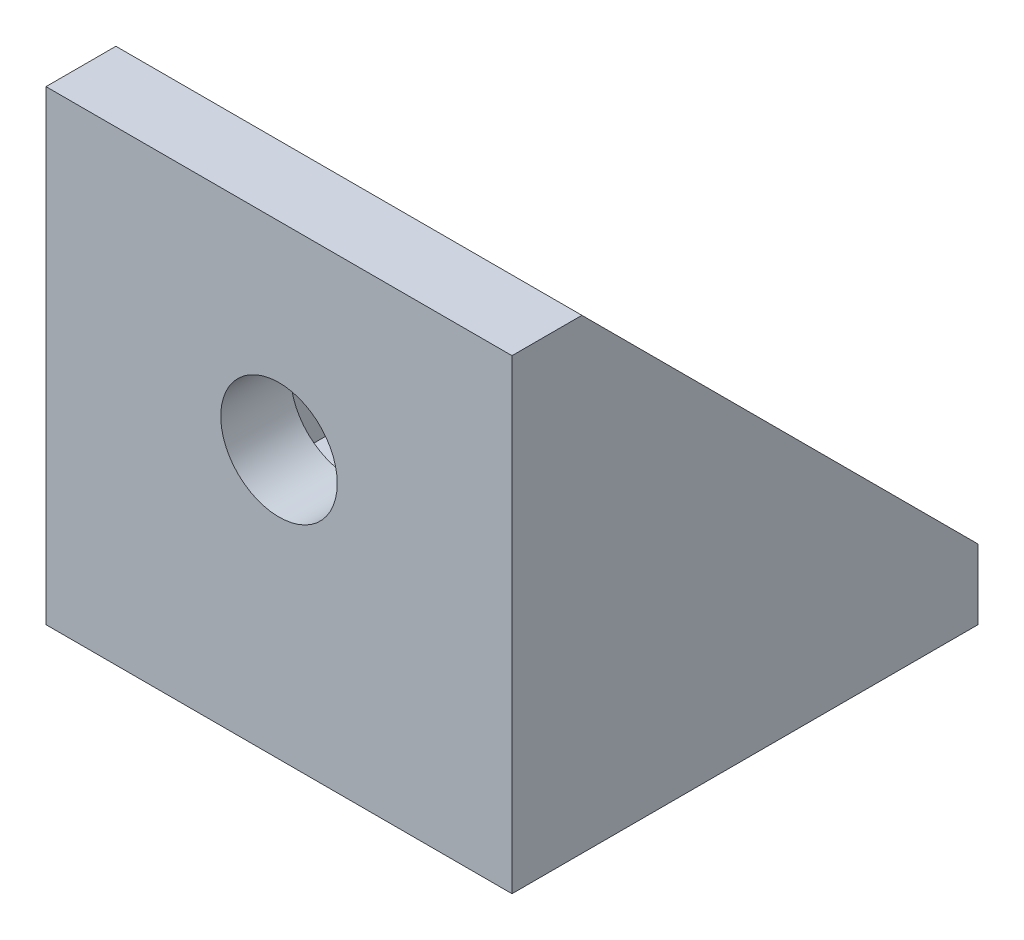
ISO-10303-21;
HEADER;
FILE_DESCRIPTION(('STEP AP214'),'2;1');
FILE_NAME('part.step','',(''),(''),'','','');
FILE_SCHEMA(('AUTOMOTIVE_DESIGN { 1 0 10303 214 1 1 1 1 }'));
ENDSEC;
DATA;
#1=APPLICATION_CONTEXT('core data for automotive mechanical design processes');
#2=APPLICATION_PROTOCOL_DEFINITION('international standard','automotive_design',2000,#1);
#3=PRODUCT_CONTEXT('',#1,'mechanical');
#4=PRODUCT('Part','Part','',(#3));
#5=PRODUCT_RELATED_PRODUCT_CATEGORY('part','',(#4));
#6=PRODUCT_DEFINITION_FORMATION('','',#4);
#7=PRODUCT_DEFINITION_CONTEXT('part definition',#1,'design');
#8=PRODUCT_DEFINITION('design','',#6,#7);
#9=PRODUCT_DEFINITION_SHAPE('','',#8);
#10=(LENGTH_UNIT() NAMED_UNIT(*) SI_UNIT(.MILLI.,.METRE.));
#11=(NAMED_UNIT(*) PLANE_ANGLE_UNIT() SI_UNIT($,.RADIAN.));
#12=(NAMED_UNIT(*) SI_UNIT($,.STERADIAN.) SOLID_ANGLE_UNIT());
#13=UNCERTAINTY_MEASURE_WITH_UNIT(LENGTH_MEASURE(1.E-05),#10,'distance_accuracy_value','');
#14=(GEOMETRIC_REPRESENTATION_CONTEXT(3) GLOBAL_UNCERTAINTY_ASSIGNED_CONTEXT((#13)) GLOBAL_UNIT_ASSIGNED_CONTEXT((#10,
#11,#12)) REPRESENTATION_CONTEXT('',''));
#15=CARTESIAN_POINT('',(0.,0.,0.));
#16=DIRECTION('',(0.,0.,1.));
#17=DIRECTION('',(1.,0.,0.));
#18=AXIS2_PLACEMENT_3D('',#15,#16,#17);
#19=CARTESIAN_POINT('',(0.,3.,0.));
#20=DIRECTION('',(0.,1.,0.));
#21=DIRECTION('',(0.,0.,1.));
#22=AXIS2_PLACEMENT_3D('',#19,#20,#21);
#23=PLANE('',#22);
#24=CARTESIAN_POINT('',(0.,3.,-1.5));
#25=DIRECTION('',(0.,1.,0.));
#26=DIRECTION('',(0.,0.,1.));
#27=AXIS2_PLACEMENT_3D('',#24,#25,#26);
#28=CIRCLE('',#27,2.5);
#29=CARTESIAN_POINT('',(0.,3.,1.));
#30=VERTEX_POINT('',#29);
#31=EDGE_CURVE('E227',#30,#30,#28,.T.);
#32=ORIENTED_EDGE('',*,*,#31,.F.);
#33=EDGE_LOOP('',(#32));
#34=FACE_BOUND('',#33,.T.);
#35=DIRECTION('',(0.,0.,-1.));
#36=VECTOR('',#35,1.);
#37=CARTESIAN_POINT('',(-8.,3.,-10.));
#38=LINE('',#37,#36);
#39=CARTESIAN_POINT('',(-8.,3.,7.));
#40=VERTEX_POINT('',#39);
#41=CARTESIAN_POINT('',(-8.,3.,-10.));
#42=VERTEX_POINT('',#41);
#43=EDGE_CURVE('E106',#40,#42,#38,.T.);
#44=ORIENTED_EDGE('',*,*,#43,.F.);
#45=DIRECTION('',(1.,0.,0.));
#46=VECTOR('',#45,1.);
#47=CARTESIAN_POINT('',(0.,3.,7.));
#48=LINE('',#47,#46);
#49=CARTESIAN_POINT('',(8.,3.,7.));
#50=VERTEX_POINT('',#49);
#51=EDGE_CURVE('E129',#40,#50,#48,.T.);
#52=ORIENTED_EDGE('',*,*,#51,.T.);
#53=DIRECTION('',(0.,0.,-1.));
#54=VECTOR('',#53,1.);
#55=CARTESIAN_POINT('',(8.,3.,-10.));
#56=LINE('',#55,#54);
#57=CARTESIAN_POINT('',(8.,3.,-10.));
#58=VERTEX_POINT('',#57);
#59=EDGE_CURVE('E140',#50,#58,#56,.T.);
#60=ORIENTED_EDGE('',*,*,#59,.T.);
#61=DIRECTION('',(-1.,0.,0.));
#62=VECTOR('',#61,1.);
#63=CARTESIAN_POINT('',(-10.,3.,-10.));
#64=LINE('',#63,#62);
#65=EDGE_CURVE('E154',#58,#42,#64,.T.);
#66=ORIENTED_EDGE('',*,*,#65,.T.);
#67=EDGE_LOOP('',(#44,#52,#60,#66));
#68=FACE_BOUND('',#67,.T.);
#69=ADVANCED_FACE('F34',(#34,#68),#23,.T.);
#70=CARTESIAN_POINT('',(0.,0.,7.));
#71=DIRECTION('',(0.,0.,1.));
#72=DIRECTION('',(1.,0.,0.));
#73=AXIS2_PLACEMENT_3D('',#70,#71,#72);
#74=PLANE('',#73);
#75=CARTESIAN_POINT('',(0.,11.5,7.));
#76=DIRECTION('',(0.,0.,1.));
#77=DIRECTION('',(1.,0.,0.));
#78=AXIS2_PLACEMENT_3D('',#75,#76,#77);
#79=CIRCLE('',#78,2.5);
#80=CARTESIAN_POINT('',(2.5,11.5,7.));
#81=VERTEX_POINT('',#80);
#82=EDGE_CURVE('E224',#81,#81,#79,.T.);
#83=ORIENTED_EDGE('',*,*,#82,.T.);
#84=EDGE_LOOP('',(#83));
#85=FACE_BOUND('',#84,.T.);
#86=ORIENTED_EDGE('',*,*,#51,.F.);
#87=DIRECTION('',(0.,-1.,0.));
#88=VECTOR('',#87,1.);
#89=CARTESIAN_POINT('',(-8.,3.,7.));
#90=LINE('',#89,#88);
#91=CARTESIAN_POINT('',(-8.,20.,7.));
#92=VERTEX_POINT('',#91);
#93=EDGE_CURVE('E104',#92,#40,#90,.T.);
#94=ORIENTED_EDGE('',*,*,#93,.F.);
#95=DIRECTION('',(-1.,0.,0.));
#96=VECTOR('',#95,1.);
#97=CARTESIAN_POINT('',(-10.,20.,7.));
#98=LINE('',#97,#96);
#99=CARTESIAN_POINT('',(8.,20.,7.));
#100=VERTEX_POINT('',#99);
#101=EDGE_CURVE('E127',#100,#92,#98,.T.);
#102=ORIENTED_EDGE('',*,*,#101,.F.);
#103=DIRECTION('',(0.,-1.,0.));
#104=VECTOR('',#103,1.);
#105=CARTESIAN_POINT('',(8.,3.,7.));
#106=LINE('',#105,#104);
#107=EDGE_CURVE('E238',#100,#50,#106,.T.);
#108=ORIENTED_EDGE('',*,*,#107,.T.);
#109=EDGE_LOOP('',(#86,#94,#102,#108));
#110=FACE_BOUND('',#109,.T.);
#111=ADVANCED_FACE('F125',(#85,#110),#74,.F.);
#112=CARTESIAN_POINT('',(10.,3.,-10.));
#113=DIRECTION('',(-1.,0.,0.));
#114=DIRECTION('',(0.,0.,1.));
#115=AXIS2_PLACEMENT_3D('',#112,#113,#114);
#116=PLANE('',#115);
#117=DIRECTION('',(0.,-1.,0.));
#118=VECTOR('',#117,1.);
#119=CARTESIAN_POINT('',(10.,3.,-10.));
#120=LINE('',#119,#118);
#121=CARTESIAN_POINT('',(10.,3.,-10.));
#122=VERTEX_POINT('',#121);
#123=CARTESIAN_POINT('',(10.,0.,-10.));
#124=VERTEX_POINT('',#123);
#125=EDGE_CURVE('E11',#122,#124,#120,.T.);
#126=ORIENTED_EDGE('',*,*,#125,.F.);
#127=DIRECTION('',(0.,0.707106781186548,0.707106781186548));
#128=VECTOR('',#127,1.);
#129=CARTESIAN_POINT('',(10.,3.,-10.));
#130=LINE('',#129,#128);
#131=CARTESIAN_POINT('',(10.,20.,7.));
#132=VERTEX_POINT('',#131);
#133=EDGE_CURVE('E119',#122,#132,#130,.T.);
#134=ORIENTED_EDGE('',*,*,#133,.T.);
#135=DIRECTION('',(0.,0.,1.));
#136=VECTOR('',#135,1.);
#137=CARTESIAN_POINT('',(10.,20.,7.));
#138=LINE('',#137,#136);
#139=CARTESIAN_POINT('',(10.,20.,10.));
#140=VERTEX_POINT('',#139);
#141=EDGE_CURVE('E138',#132,#140,#138,.T.);
#142=ORIENTED_EDGE('',*,*,#141,.T.);
#143=DIRECTION('',(0.,-1.,0.));
#144=VECTOR('',#143,1.);
#145=CARTESIAN_POINT('',(10.,3.,10.));
#146=LINE('',#145,#144);
#147=CARTESIAN_POINT('',(10.,0.,10.));
#148=VERTEX_POINT('',#147);
#149=EDGE_CURVE('E153',#140,#148,#146,.T.);
#150=ORIENTED_EDGE('',*,*,#149,.T.);
#151=DIRECTION('',(0.,0.,-1.));
#152=VECTOR('',#151,1.);
#153=CARTESIAN_POINT('',(10.,0.,-10.));
#154=LINE('',#153,#152);
#155=EDGE_CURVE('E150',#148,#124,#154,.T.);
#156=ORIENTED_EDGE('',*,*,#155,.T.);
#157=EDGE_LOOP('',(#126,#134,#142,#150,#156));
#158=FACE_BOUND('',#157,.T.);
#159=ADVANCED_FACE('F36',(#158),#116,.F.);
#160=CARTESIAN_POINT('',(-10.,3.,-10.));
#161=DIRECTION('',(0.,0.,1.));
#162=DIRECTION('',(1.,0.,0.));
#163=AXIS2_PLACEMENT_3D('',#160,#161,#162);
#164=PLANE('',#163);
#165=DIRECTION('',(-1.,0.,0.));
#166=VECTOR('',#165,1.);
#167=CARTESIAN_POINT('',(-10.,0.,-10.));
#168=LINE('',#167,#166);
#169=CARTESIAN_POINT('',(-10.,0.,-10.));
#170=VERTEX_POINT('',#169);
#171=EDGE_CURVE('E156',#124,#170,#168,.T.);
#172=ORIENTED_EDGE('',*,*,#171,.T.);
#173=DIRECTION('',(0.,-1.,0.));
#174=VECTOR('',#173,1.);
#175=CARTESIAN_POINT('',(-10.,3.,-10.));
#176=LINE('',#175,#174);
#177=CARTESIAN_POINT('',(-10.,3.,-10.));
#178=VERTEX_POINT('',#177);
#179=EDGE_CURVE('E43',#178,#170,#176,.T.);
#180=ORIENTED_EDGE('',*,*,#179,.F.);
#181=DIRECTION('',(-1.,0.,0.));
#182=VECTOR('',#181,1.);
#183=CARTESIAN_POINT('',(-8.,3.,-10.));
#184=LINE('',#183,#182);
#185=EDGE_CURVE('E120',#42,#178,#184,.T.);
#186=ORIENTED_EDGE('',*,*,#185,.F.);
#187=ORIENTED_EDGE('',*,*,#65,.F.);
#188=EDGE_CURVE('E151',#122,#58,#64,.T.);
#189=ORIENTED_EDGE('',*,*,#188,.F.);
#190=ORIENTED_EDGE('',*,*,#125,.T.);
#191=EDGE_LOOP('',(#172,#180,#186,#187,#189,#190));
#192=FACE_BOUND('',#191,.T.);
#193=ADVANCED_FACE('F182',(#192),#164,.F.);
#194=CARTESIAN_POINT('',(-10.,3.,-10.));
#195=DIRECTION('',(1.,0.,0.));
#196=DIRECTION('',(0.,0.,-1.));
#197=AXIS2_PLACEMENT_3D('',#194,#195,#196);
#198=PLANE('',#197);
#199=DIRECTION('',(0.,-1.,0.));
#200=VECTOR('',#199,1.);
#201=CARTESIAN_POINT('',(-10.,3.,10.));
#202=LINE('',#201,#200);
#203=CARTESIAN_POINT('',(-10.,20.,10.));
#204=VERTEX_POINT('',#203);
#205=CARTESIAN_POINT('',(-10.,0.,10.));
#206=VERTEX_POINT('',#205);
#207=EDGE_CURVE('E161',#204,#206,#202,.T.);
#208=ORIENTED_EDGE('',*,*,#207,.F.);
#209=DIRECTION('',(0.,0.,1.));
#210=VECTOR('',#209,1.);
#211=CARTESIAN_POINT('',(-10.,20.,7.));
#212=LINE('',#211,#210);
#213=CARTESIAN_POINT('',(-10.,20.,7.));
#214=VERTEX_POINT('',#213);
#215=EDGE_CURVE('E145',#214,#204,#212,.T.);
#216=ORIENTED_EDGE('',*,*,#215,.F.);
#217=DIRECTION('',(0.,0.707106781186548,0.707106781186548));
#218=VECTOR('',#217,1.);
#219=CARTESIAN_POINT('',(-10.,3.,-10.));
#220=LINE('',#219,#218);
#221=EDGE_CURVE('E109',#178,#214,#220,.T.);
#222=ORIENTED_EDGE('',*,*,#221,.F.);
#223=ORIENTED_EDGE('',*,*,#179,.T.);
#224=DIRECTION('',(0.,0.,1.));
#225=VECTOR('',#224,1.);
#226=CARTESIAN_POINT('',(-10.,0.,-10.));
#227=LINE('',#226,#225);
#228=EDGE_CURVE('E58',#170,#206,#227,.T.);
#229=ORIENTED_EDGE('',*,*,#228,.T.);
#230=EDGE_LOOP('',(#208,#216,#222,#223,#229));
#231=FACE_BOUND('',#230,.T.);
#232=ADVANCED_FACE('F164',(#231),#198,.F.);
#233=CARTESIAN_POINT('',(-10.,3.,10.));
#234=DIRECTION('',(0.,0.,-1.));
#235=DIRECTION('',(-1.,0.,0.));
#236=AXIS2_PLACEMENT_3D('',#233,#234,#235);
#237=PLANE('',#236);
#238=CARTESIAN_POINT('',(0.,11.5,10.));
#239=DIRECTION('',(0.,0.,1.));
#240=DIRECTION('',(1.,0.,0.));
#241=AXIS2_PLACEMENT_3D('',#238,#239,#240);
#242=CIRCLE('',#241,2.5);
#243=CARTESIAN_POINT('',(2.5,11.5,10.));
#244=VERTEX_POINT('',#243);
#245=EDGE_CURVE('E221',#244,#244,#242,.T.);
#246=ORIENTED_EDGE('',*,*,#245,.F.);
#247=EDGE_LOOP('',(#246));
#248=FACE_BOUND('',#247,.T.);
#249=DIRECTION('',(1.,0.,0.));
#250=VECTOR('',#249,1.);
#251=CARTESIAN_POINT('',(-10.,0.,10.));
#252=LINE('',#251,#250);
#253=EDGE_CURVE('E50',#206,#148,#252,.T.);
#254=ORIENTED_EDGE('',*,*,#253,.T.);
#255=ORIENTED_EDGE('',*,*,#149,.F.);
#256=DIRECTION('',(-1.,0.,0.));
#257=VECTOR('',#256,1.);
#258=CARTESIAN_POINT('',(-10.,20.,10.));
#259=LINE('',#258,#257);
#260=EDGE_CURVE('E136',#140,#204,#259,.T.);
#261=ORIENTED_EDGE('',*,*,#260,.T.);
#262=ORIENTED_EDGE('',*,*,#207,.T.);
#263=EDGE_LOOP('',(#254,#255,#261,#262));
#264=FACE_BOUND('',#263,.T.);
#265=ADVANCED_FACE('F172',(#248,#264),#237,.F.);
#266=CARTESIAN_POINT('',(0.,0.,0.));
#267=DIRECTION('',(0.,1.,0.));
#268=DIRECTION('',(0.,0.,1.));
#269=AXIS2_PLACEMENT_3D('',#266,#267,#268);
#270=PLANE('',#269);
#271=CARTESIAN_POINT('',(0.,0.,-1.5));
#272=DIRECTION('',(0.,1.,0.));
#273=DIRECTION('',(0.,0.,1.));
#274=AXIS2_PLACEMENT_3D('',#271,#272,#273);
#275=CIRCLE('',#274,2.5);
#276=CARTESIAN_POINT('',(0.,0.,1.));
#277=VERTEX_POINT('',#276);
#278=EDGE_CURVE('E38',#277,#277,#275,.T.);
#279=ORIENTED_EDGE('',*,*,#278,.T.);
#280=EDGE_LOOP('',(#279));
#281=FACE_BOUND('',#280,.T.);
#282=ORIENTED_EDGE('',*,*,#253,.F.);
#283=ORIENTED_EDGE('',*,*,#228,.F.);
#284=ORIENTED_EDGE('',*,*,#171,.F.);
#285=ORIENTED_EDGE('',*,*,#155,.F.);
#286=EDGE_LOOP('',(#282,#283,#284,#285));
#287=FACE_BOUND('',#286,.T.);
#288=ADVANCED_FACE('F168',(#281,#287),#270,.F.);
#289=CARTESIAN_POINT('',(-10.,20.,7.));
#290=DIRECTION('',(0.,1.,0.));
#291=DIRECTION('',(0.,0.,1.));
#292=AXIS2_PLACEMENT_3D('',#289,#290,#291);
#293=PLANE('',#292);
#294=ORIENTED_EDGE('',*,*,#260,.F.);
#295=ORIENTED_EDGE('',*,*,#141,.F.);
#296=EDGE_CURVE('E135',#132,#100,#98,.T.);
#297=ORIENTED_EDGE('',*,*,#296,.T.);
#298=ORIENTED_EDGE('',*,*,#101,.T.);
#299=DIRECTION('',(-1.,0.,0.));
#300=VECTOR('',#299,1.);
#301=CARTESIAN_POINT('',(-8.,20.,7.));
#302=LINE('',#301,#300);
#303=EDGE_CURVE('E112',#92,#214,#302,.T.);
#304=ORIENTED_EDGE('',*,*,#303,.T.);
#305=ORIENTED_EDGE('',*,*,#215,.T.);
#306=EDGE_LOOP('',(#294,#295,#297,#298,#304,#305));
#307=FACE_BOUND('',#306,.T.);
#308=ADVANCED_FACE('F132',(#307),#293,.T.);
#309=CARTESIAN_POINT('',(8.,3.,-10.));
#310=DIRECTION('',(0.,0.707106781186547,-0.707106781186547));
#311=DIRECTION('',(0.,0.707106781186548,0.707106781186548));
#312=AXIS2_PLACEMENT_3D('',#309,#310,#311);
#313=PLANE('',#312);
#314=ORIENTED_EDGE('',*,*,#133,.F.);
#315=ORIENTED_EDGE('',*,*,#188,.T.);
#316=DIRECTION('',(0.,0.707106781186548,0.707106781186548));
#317=VECTOR('',#316,1.);
#318=CARTESIAN_POINT('',(8.,3.,-10.));
#319=LINE('',#318,#317);
#320=EDGE_CURVE('E235',#58,#100,#319,.T.);
#321=ORIENTED_EDGE('',*,*,#320,.T.);
#322=ORIENTED_EDGE('',*,*,#296,.F.);
#323=EDGE_LOOP('',(#314,#315,#321,#322));
#324=FACE_BOUND('',#323,.T.);
#325=ADVANCED_FACE('F197',(#324),#313,.T.);
#326=CARTESIAN_POINT('',(8.,0.,0.));
#327=DIRECTION('',(1.,0.,0.));
#328=DIRECTION('',(0.,0.,-1.));
#329=AXIS2_PLACEMENT_3D('',#326,#327,#328);
#330=PLANE('',#329);
#331=ORIENTED_EDGE('',*,*,#320,.F.);
#332=ORIENTED_EDGE('',*,*,#59,.F.);
#333=ORIENTED_EDGE('',*,*,#107,.F.);
#334=EDGE_LOOP('',(#331,#332,#333));
#335=FACE_BOUND('',#334,.T.);
#336=ADVANCED_FACE('F201',(#335),#330,.F.);
#337=CARTESIAN_POINT('',(-8.,3.,-10.));
#338=DIRECTION('',(0.,-0.707106781186547,0.707106781186547));
#339=DIRECTION('',(0.,-0.707106781186548,-0.707106781186548));
#340=AXIS2_PLACEMENT_3D('',#337,#338,#339);
#341=PLANE('',#340);
#342=ORIENTED_EDGE('',*,*,#221,.T.);
#343=ORIENTED_EDGE('',*,*,#303,.F.);
#344=DIRECTION('',(0.,0.707106781186548,0.707106781186548));
#345=VECTOR('',#344,1.);
#346=CARTESIAN_POINT('',(-8.,3.,-10.));
#347=LINE('',#346,#345);
#348=EDGE_CURVE('E100',#42,#92,#347,.T.);
#349=ORIENTED_EDGE('',*,*,#348,.F.);
#350=ORIENTED_EDGE('',*,*,#185,.T.);
#351=EDGE_LOOP('',(#342,#343,#349,#350));
#352=FACE_BOUND('',#351,.T.);
#353=ADVANCED_FACE('F113',(#352),#341,.F.);
#354=CARTESIAN_POINT('',(-8.,0.,0.));
#355=DIRECTION('',(1.,0.,0.));
#356=DIRECTION('',(0.,0.,-1.));
#357=AXIS2_PLACEMENT_3D('',#354,#355,#356);
#358=PLANE('',#357);
#359=ORIENTED_EDGE('',*,*,#348,.T.);
#360=ORIENTED_EDGE('',*,*,#93,.T.);
#361=ORIENTED_EDGE('',*,*,#43,.T.);
#362=EDGE_LOOP('',(#359,#360,#361));
#363=FACE_BOUND('',#362,.T.);
#364=ADVANCED_FACE('F102',(#363),#358,.T.);
#365=CARTESIAN_POINT('',(0.,-1.2E-05,-1.5));
#366=DIRECTION('',(0.,1.,0.));
#367=DIRECTION('',(0.,0.,1.));
#368=AXIS2_PLACEMENT_3D('',#365,#366,#367);
#369=CYLINDRICAL_SURFACE('',#368,2.5);
#370=ORIENTED_EDGE('',*,*,#31,.T.);
#371=EDGE_LOOP('',(#370));
#372=FACE_BOUND('',#371,.T.);
#373=ORIENTED_EDGE('',*,*,#278,.F.);
#374=EDGE_LOOP('',(#373));
#375=FACE_BOUND('',#374,.T.);
#376=ADVANCED_FACE('F210',(#372,#375),#369,.F.);
#377=CARTESIAN_POINT('',(0.,11.5,-10.));
#378=DIRECTION('',(0.,0.,1.));
#379=DIRECTION('',(1.,0.,0.));
#380=AXIS2_PLACEMENT_3D('',#377,#378,#379);
#381=CYLINDRICAL_SURFACE('',#380,2.5);
#382=ORIENTED_EDGE('',*,*,#245,.T.);
#383=EDGE_LOOP('',(#382));
#384=FACE_BOUND('',#383,.T.);
#385=ORIENTED_EDGE('',*,*,#82,.F.);
#386=EDGE_LOOP('',(#385));
#387=FACE_BOUND('',#386,.T.);
#388=ADVANCED_FACE('F213',(#384,#387),#381,.F.);
#389=CLOSED_SHELL('',(#69,#111,#159,#193,#232,#265,#288,#308,#325,#336,#353,#364,#376,#388));
#390=MANIFOLD_SOLID_BREP('B2',#389);
#391=ADVANCED_BREP_SHAPE_REPRESENTATION('',(#18,#390),#14);
#392=SHAPE_DEFINITION_REPRESENTATION(#9,#391);
ENDSEC;
END-ISO-10303-21;
